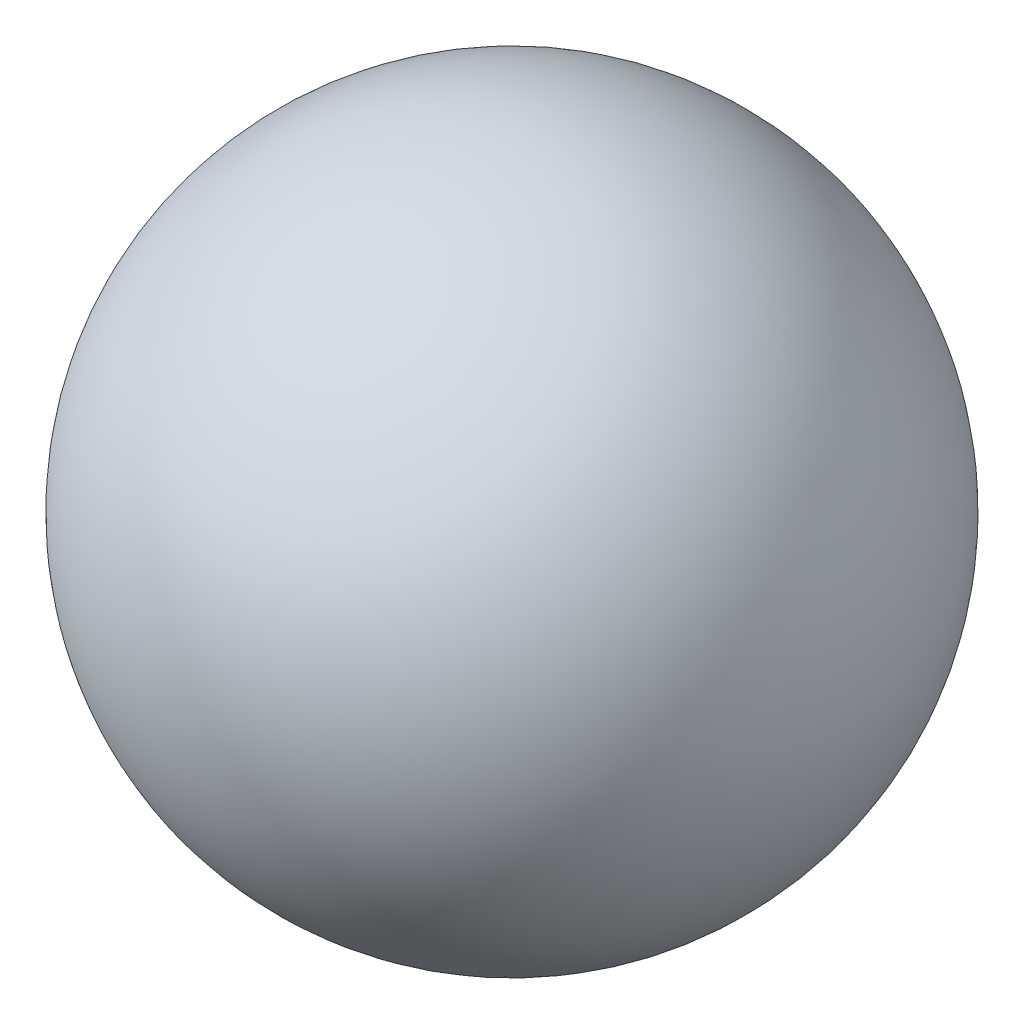
ISO-10303-21;
HEADER;
FILE_DESCRIPTION(('STEP AP214'),'2;1');
FILE_NAME('part.step','',(''),(''),'','','');
FILE_SCHEMA(('AUTOMOTIVE_DESIGN { 1 0 10303 214 1 1 1 1 }'));
ENDSEC;
DATA;
#1=APPLICATION_CONTEXT('core data for automotive mechanical design processes');
#2=APPLICATION_PROTOCOL_DEFINITION('international standard','automotive_design',2000,#1);
#3=PRODUCT_CONTEXT('',#1,'mechanical');
#4=PRODUCT('Part','Part','',(#3));
#5=PRODUCT_RELATED_PRODUCT_CATEGORY('part','',(#4));
#6=PRODUCT_DEFINITION_FORMATION('','',#4);
#7=PRODUCT_DEFINITION_CONTEXT('part definition',#1,'design');
#8=PRODUCT_DEFINITION('design','',#6,#7);
#9=PRODUCT_DEFINITION_SHAPE('','',#8);
#10=(LENGTH_UNIT() NAMED_UNIT(*) SI_UNIT(.MILLI.,.METRE.));
#11=(NAMED_UNIT(*) PLANE_ANGLE_UNIT() SI_UNIT($,.RADIAN.));
#12=(NAMED_UNIT(*) SI_UNIT($,.STERADIAN.) SOLID_ANGLE_UNIT());
#13=UNCERTAINTY_MEASURE_WITH_UNIT(LENGTH_MEASURE(1.E-05),#10,'distance_accuracy_value','');
#14=(GEOMETRIC_REPRESENTATION_CONTEXT(3) GLOBAL_UNCERTAINTY_ASSIGNED_CONTEXT((#13)) GLOBAL_UNIT_ASSIGNED_CONTEXT((#10,
#11,#12)) REPRESENTATION_CONTEXT('',''));
#15=CARTESIAN_POINT('',(0.,0.,0.));
#16=DIRECTION('',(0.,0.,1.));
#17=DIRECTION('',(1.,0.,0.));
#18=AXIS2_PLACEMENT_3D('',#15,#16,#17);
#19=CARTESIAN_POINT('',(0.,0.,0.));
#20=DIRECTION('',(0.,0.,-1.));
#21=DIRECTION('',(1.,0.,0.));
#22=AXIS2_PLACEMENT_3D('',#19,#20,#21);
#23=SPHERICAL_SURFACE('',#22,3.5);
#24=CARTESIAN_POINT('',(0.,0.,-3.5));
#25=VERTEX_POINT('',#24);
#26=VERTEX_LOOP('',#25);
#27=FACE_BOUND('',#26,.T.);
#28=ADVANCED_FACE('F33',(#27),#23,.T.);
#29=CLOSED_SHELL('',(#28));
#30=MANIFOLD_SOLID_BREP('B2',#29);
#31=ADVANCED_BREP_SHAPE_REPRESENTATION('',(#18,#30),#14);
#32=SHAPE_DEFINITION_REPRESENTATION(#9,#31);
ENDSEC;
END-ISO-10303-21;
